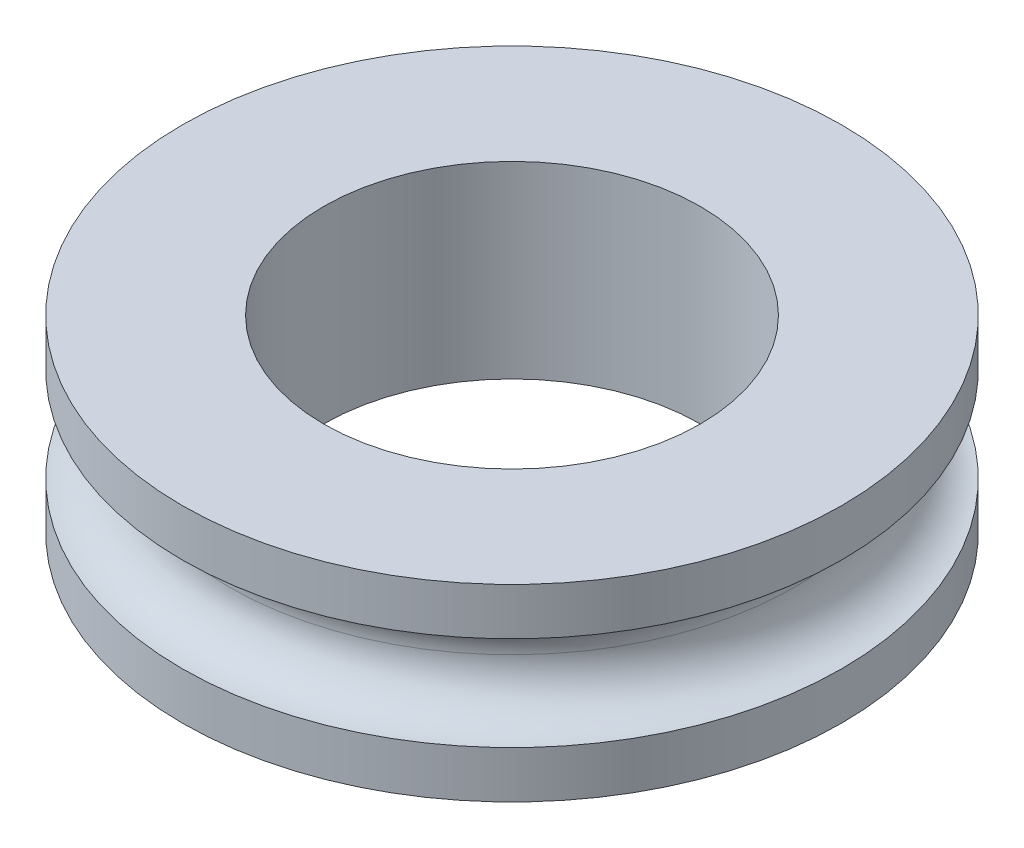
ISO-10303-21;
HEADER;
FILE_DESCRIPTION(('STEP AP214'),'2;1');
FILE_NAME('part.step','',(''),(''),'','','');
FILE_SCHEMA(('AUTOMOTIVE_DESIGN { 1 0 10303 214 1 1 1 1 }'));
ENDSEC;
DATA;
#1=APPLICATION_CONTEXT('core data for automotive mechanical design processes');
#2=APPLICATION_PROTOCOL_DEFINITION('international standard','automotive_design',2000,#1);
#3=PRODUCT_CONTEXT('',#1,'mechanical');
#4=PRODUCT('Part','Part','',(#3));
#5=PRODUCT_RELATED_PRODUCT_CATEGORY('part','',(#4));
#6=PRODUCT_DEFINITION_FORMATION('','',#4);
#7=PRODUCT_DEFINITION_CONTEXT('part definition',#1,'design');
#8=PRODUCT_DEFINITION('design','',#6,#7);
#9=PRODUCT_DEFINITION_SHAPE('','',#8);
#10=(LENGTH_UNIT() NAMED_UNIT(*) SI_UNIT(.MILLI.,.METRE.));
#11=(NAMED_UNIT(*) PLANE_ANGLE_UNIT() SI_UNIT($,.RADIAN.));
#12=(NAMED_UNIT(*) SI_UNIT($,.STERADIAN.) SOLID_ANGLE_UNIT());
#13=UNCERTAINTY_MEASURE_WITH_UNIT(LENGTH_MEASURE(1.E-05),#10,'distance_accuracy_value','');
#14=(GEOMETRIC_REPRESENTATION_CONTEXT(3) GLOBAL_UNCERTAINTY_ASSIGNED_CONTEXT((#13)) GLOBAL_UNIT_ASSIGNED_CONTEXT((#10,
#11,#12)) REPRESENTATION_CONTEXT('',''));
#15=CARTESIAN_POINT('',(0.,0.,0.));
#16=DIRECTION('',(0.,0.,1.));
#17=DIRECTION('',(1.,0.,0.));
#18=AXIS2_PLACEMENT_3D('',#15,#16,#17);
#19=CARTESIAN_POINT('',(0.,2.,0.));
#20=DIRECTION('',(0.,-1.,0.));
#21=DIRECTION('',(0.,0.,-1.));
#22=AXIS2_PLACEMENT_3D('',#19,#20,#21);
#23=CYLINDRICAL_SURFACE('',#22,7.);
#24=CARTESIAN_POINT('',(0.,-2.,0.));
#25=DIRECTION('',(0.,1.,0.));
#26=DIRECTION('',(0.,0.,1.));
#27=AXIS2_PLACEMENT_3D('',#24,#25,#26);
#28=CIRCLE('',#27,7.);
#29=CARTESIAN_POINT('',(0.,-2.,7.));
#30=VERTEX_POINT('',#29);
#31=EDGE_CURVE('E49',#30,#30,#28,.T.);
#32=ORIENTED_EDGE('',*,*,#31,.T.);
#33=EDGE_LOOP('',(#32));
#34=FACE_BOUND('',#33,.T.);
#35=CARTESIAN_POINT('',(0.,-1.,0.));
#36=DIRECTION('',(0.,1.,0.));
#37=DIRECTION('',(0.,0.,1.));
#38=AXIS2_PLACEMENT_3D('',#35,#36,#37);
#39=CIRCLE('',#38,7.);
#40=CARTESIAN_POINT('',(0.,-1.,7.));
#41=VERTEX_POINT('',#40);
#42=EDGE_CURVE('E51',#41,#41,#39,.T.);
#43=ORIENTED_EDGE('',*,*,#42,.F.);
#44=EDGE_LOOP('',(#43));
#45=FACE_BOUND('',#44,.T.);
#46=ADVANCED_FACE('F32',(#34,#45),#23,.T.);
#47=CARTESIAN_POINT('',(0.,1.,0.));
#48=DIRECTION('',(0.,1.,0.));
#49=DIRECTION('',(0.,0.,1.));
#50=AXIS2_PLACEMENT_3D('',#47,#48,#49);
#51=CIRCLE('',#50,7.);
#52=CARTESIAN_POINT('',(0.,1.,7.));
#53=VERTEX_POINT('',#52);
#54=EDGE_CURVE('E89',#53,#53,#51,.T.);
#55=ORIENTED_EDGE('',*,*,#54,.T.);
#56=EDGE_LOOP('',(#55));
#57=FACE_BOUND('',#56,.T.);
#58=CARTESIAN_POINT('',(0.,2.,0.));
#59=DIRECTION('',(0.,1.,0.));
#60=DIRECTION('',(0.,0.,1.));
#61=AXIS2_PLACEMENT_3D('',#58,#59,#60);
#62=CIRCLE('',#61,7.);
#63=CARTESIAN_POINT('',(0.,2.,7.));
#64=VERTEX_POINT('',#63);
#65=EDGE_CURVE('E40',#64,#64,#62,.T.);
#66=ORIENTED_EDGE('',*,*,#65,.F.);
#67=EDGE_LOOP('',(#66));
#68=FACE_BOUND('',#67,.T.);
#69=ADVANCED_FACE('F60',(#57,#68),#23,.T.);
#70=CARTESIAN_POINT('',(0.,2.,0.));
#71=DIRECTION('',(0.,-1.,0.));
#72=DIRECTION('',(0.,0.,-1.));
#73=AXIS2_PLACEMENT_3D('',#70,#71,#72);
#74=CYLINDRICAL_SURFACE('',#73,4.);
#75=CARTESIAN_POINT('',(0.,2.,0.));
#76=DIRECTION('',(0.,1.,0.));
#77=DIRECTION('',(0.,0.,1.));
#78=AXIS2_PLACEMENT_3D('',#75,#76,#77);
#79=CIRCLE('',#78,4.);
#80=CARTESIAN_POINT('',(0.,2.,4.));
#81=VERTEX_POINT('',#80);
#82=EDGE_CURVE('E10',#81,#81,#79,.T.);
#83=ORIENTED_EDGE('',*,*,#82,.T.);
#84=EDGE_LOOP('',(#83));
#85=FACE_BOUND('',#84,.T.);
#86=CARTESIAN_POINT('',(0.,-2.,0.));
#87=DIRECTION('',(0.,1.,0.));
#88=DIRECTION('',(0.,0.,1.));
#89=AXIS2_PLACEMENT_3D('',#86,#87,#88);
#90=CIRCLE('',#89,4.);
#91=CARTESIAN_POINT('',(0.,-2.,4.));
#92=VERTEX_POINT('',#91);
#93=EDGE_CURVE('E45',#92,#92,#90,.T.);
#94=ORIENTED_EDGE('',*,*,#93,.F.);
#95=EDGE_LOOP('',(#94));
#96=FACE_BOUND('',#95,.T.);
#97=ADVANCED_FACE('F57',(#85,#96),#74,.F.);
#98=CARTESIAN_POINT('',(0.,2.,0.));
#99=DIRECTION('',(0.,1.,0.));
#100=DIRECTION('',(0.,0.,1.));
#101=AXIS2_PLACEMENT_3D('',#98,#99,#100);
#102=PLANE('',#101);
#103=ORIENTED_EDGE('',*,*,#65,.T.);
#104=EDGE_LOOP('',(#103));
#105=FACE_BOUND('',#104,.T.);
#106=ORIENTED_EDGE('',*,*,#82,.F.);
#107=EDGE_LOOP('',(#106));
#108=FACE_BOUND('',#107,.T.);
#109=ADVANCED_FACE('F59',(#105,#108),#102,.T.);
#110=CARTESIAN_POINT('',(0.,-2.,0.));
#111=DIRECTION('',(0.,1.,0.));
#112=DIRECTION('',(0.,0.,1.));
#113=AXIS2_PLACEMENT_3D('',#110,#111,#112);
#114=PLANE('',#113);
#115=ORIENTED_EDGE('',*,*,#31,.F.);
#116=EDGE_LOOP('',(#115));
#117=FACE_BOUND('',#116,.T.);
#118=ORIENTED_EDGE('',*,*,#93,.T.);
#119=EDGE_LOOP('',(#118));
#120=FACE_BOUND('',#119,.T.);
#121=ADVANCED_FACE('F55',(#117,#120),#114,.F.);
#122=CARTESIAN_POINT('',(0.,0.,0.));
#123=DIRECTION('',(0.,1.,0.));
#124=DIRECTION('',(0.,0.,1.));
#125=AXIS2_PLACEMENT_3D('',#122,#123,#124);
#126=TOROIDAL_SURFACE('',#125,7.,1.);
#127=ORIENTED_EDGE('',*,*,#54,.F.);
#128=EDGE_LOOP('',(#127));
#129=FACE_BOUND('',#128,.T.);
#130=CARTESIAN_POINT('',(0.,0.,0.));
#131=DIRECTION('',(0.,1.,0.));
#132=DIRECTION('',(0.,0.,1.));
#133=AXIS2_PLACEMENT_3D('',#130,#131,#132);
#134=CIRCLE('',#133,6.);
#135=CARTESIAN_POINT('',(0.,0.,6.));
#136=VERTEX_POINT('',#135);
#137=EDGE_CURVE('E36',#136,#136,#134,.F.);
#138=ORIENTED_EDGE('',*,*,#137,.F.);
#139=EDGE_LOOP('',(#138));
#140=FACE_BOUND('',#139,.T.);
#141=ADVANCED_FACE('F34',(#129,#140),#126,.F.);
#142=CARTESIAN_POINT('',(0.,0.,0.));
#143=DIRECTION('',(0.,1.,0.));
#144=DIRECTION('',(0.,0.,1.));
#145=AXIS2_PLACEMENT_3D('',#142,#143,#144);
#146=TOROIDAL_SURFACE('',#145,7.,1.);
#147=ORIENTED_EDGE('',*,*,#42,.T.);
#148=EDGE_LOOP('',(#147));
#149=FACE_BOUND('',#148,.T.);
#150=ORIENTED_EDGE('',*,*,#137,.T.);
#151=EDGE_LOOP('',(#150));
#152=FACE_BOUND('',#151,.T.);
#153=ADVANCED_FACE('F76',(#149,#152),#146,.F.);
#154=CLOSED_SHELL('',(#46,#69,#97,#109,#121,#141,#153));
#155=MANIFOLD_SOLID_BREP('B2',#154);
#156=ADVANCED_BREP_SHAPE_REPRESENTATION('',(#18,#155),#14);
#157=SHAPE_DEFINITION_REPRESENTATION(#9,#156);
ENDSEC;
END-ISO-10303-21;
